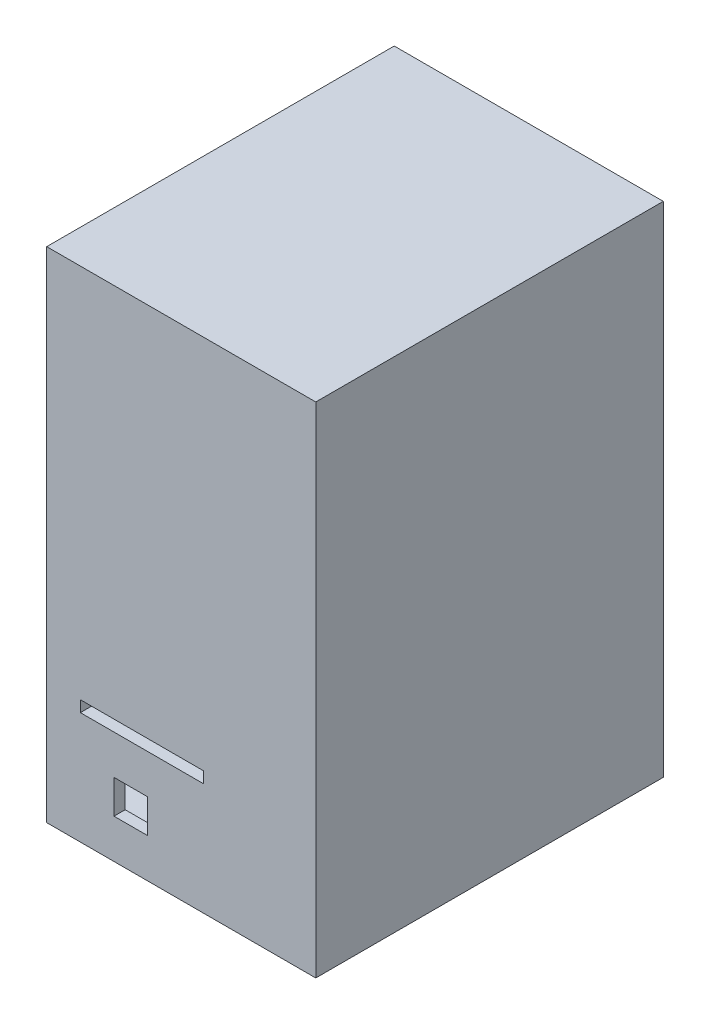
ISO-10303-21;
HEADER;
FILE_DESCRIPTION(('STEP AP214'),'2;1');
FILE_NAME('part.step','',(''),(''),'','','');
FILE_SCHEMA(('AUTOMOTIVE_DESIGN { 1 0 10303 214 1 1 1 1 }'));
ENDSEC;
DATA;
#1=APPLICATION_CONTEXT('core data for automotive mechanical design processes');
#2=APPLICATION_PROTOCOL_DEFINITION('international standard','automotive_design',2000,#1);
#3=PRODUCT_CONTEXT('',#1,'mechanical');
#4=PRODUCT('Part','Part','',(#3));
#5=PRODUCT_RELATED_PRODUCT_CATEGORY('part','',(#4));
#6=PRODUCT_DEFINITION_FORMATION('','',#4);
#7=PRODUCT_DEFINITION_CONTEXT('part definition',#1,'design');
#8=PRODUCT_DEFINITION('design','',#6,#7);
#9=PRODUCT_DEFINITION_SHAPE('','',#8);
#10=(LENGTH_UNIT() NAMED_UNIT(*) SI_UNIT(.MILLI.,.METRE.));
#11=(NAMED_UNIT(*) PLANE_ANGLE_UNIT() SI_UNIT($,.RADIAN.));
#12=(NAMED_UNIT(*) SI_UNIT($,.STERADIAN.) SOLID_ANGLE_UNIT());
#13=UNCERTAINTY_MEASURE_WITH_UNIT(LENGTH_MEASURE(1.E-05),#10,'distance_accuracy_value','');
#14=(GEOMETRIC_REPRESENTATION_CONTEXT(3) GLOBAL_UNCERTAINTY_ASSIGNED_CONTEXT((#13)) GLOBAL_UNIT_ASSIGNED_CONTEXT((#10,
#11,#12)) REPRESENTATION_CONTEXT('',''));
#15=CARTESIAN_POINT('',(0.,0.,0.));
#16=DIRECTION('',(0.,0.,1.));
#17=DIRECTION('',(1.,0.,0.));
#18=AXIS2_PLACEMENT_3D('',#15,#16,#17);
#19=CARTESIAN_POINT('',(-11.076923076923,-201.769230769231,-135.));
#20=DIRECTION('',(1.,0.,0.));
#21=DIRECTION('',(0.,1.,0.));
#22=AXIS2_PLACEMENT_3D('',#19,#20,#21);
#23=CYLINDRICAL_SURFACE('',#22,35.);
#24=CARTESIAN_POINT('',(-11.076923076923,-201.769230769231,-135.));
#25=DIRECTION('',(-1.,0.,0.));
#26=DIRECTION('',(0.,-1.,0.));
#27=AXIS2_PLACEMENT_3D('',#24,#25,#26);
#28=CIRCLE('',#27,35.);
#29=CARTESIAN_POINT('',(-11.076923076923,-236.769230769231,-135.));
#30=VERTEX_POINT('',#29);
#31=EDGE_CURVE('E11',#30,#30,#28,.T.);
#32=ORIENTED_EDGE('',*,*,#31,.F.);
#33=EDGE_LOOP('',(#32));
#34=FACE_BOUND('',#33,.T.);
#35=CARTESIAN_POINT('',(18.923076923077,-201.769230769231,-135.));
#36=DIRECTION('',(-1.,0.,0.));
#37=DIRECTION('',(0.,-1.,0.));
#38=AXIS2_PLACEMENT_3D('',#35,#36,#37);
#39=CIRCLE('',#38,35.);
#40=CARTESIAN_POINT('',(18.923076923077,-236.769230769231,-135.));
#41=VERTEX_POINT('',#40);
#42=EDGE_CURVE('E44',#41,#41,#39,.T.);
#43=ORIENTED_EDGE('',*,*,#42,.T.);
#44=EDGE_LOOP('',(#43));
#45=FACE_BOUND('',#44,.T.);
#46=ADVANCED_FACE('F41',(#34,#45),#23,.T.);
#47=CARTESIAN_POINT('',(-11.076923076923,-201.769230769231,-135.));
#48=DIRECTION('',(-1.,0.,0.));
#49=DIRECTION('',(0.,-1.,0.));
#50=AXIS2_PLACEMENT_3D('',#47,#48,#49);
#51=PLANE('',#50);
#52=ORIENTED_EDGE('',*,*,#31,.T.);
#53=EDGE_LOOP('',(#52));
#54=FACE_BOUND('',#53,.T.);
#55=ADVANCED_FACE('F56',(#54),#51,.T.);
#56=CARTESIAN_POINT('',(18.923076923077,-201.769230769231,-135.));
#57=DIRECTION('',(-1.,0.,0.));
#58=DIRECTION('',(0.,-1.,0.));
#59=AXIS2_PLACEMENT_3D('',#56,#57,#58);
#60=PLANE('',#59);
#61=ORIENTED_EDGE('',*,*,#42,.F.);
#62=EDGE_LOOP('',(#61));
#63=FACE_BOUND('',#62,.T.);
#64=ADVANCED_FACE('F54',(#63),#60,.F.);
#65=CLOSED_SHELL('',(#46,#55,#64));
#66=MANIFOLD_SOLID_BREP('B2',#65);
#67=CARTESIAN_POINT('',(0.,0.,-330.));
#68=DIRECTION('',(0.,0.,1.));
#69=DIRECTION('',(1.,0.,0.));
#70=AXIS2_PLACEMENT_3D('',#67,#68,#69);
#71=PLANE('',#70);
#72=DIRECTION('',(0.,-1.,0.));
#73=VECTOR('',#72,1.);
#74=CARTESIAN_POINT('',(68.923076923077,143.230769230769,-330.));
#75=LINE('',#74,#73);
#76=CARTESIAN_POINT('',(68.923076923077,143.230769230769,-330.));
#77=VERTEX_POINT('',#76);
#78=CARTESIAN_POINT('',(68.923076923077,-191.769230769231,-330.));
#79=VERTEX_POINT('',#78);
#80=EDGE_CURVE('E454',#77,#79,#75,.T.);
#81=ORIENTED_EDGE('',*,*,#80,.F.);
#82=DIRECTION('',(-1.,0.,0.));
#83=VECTOR('',#82,1.);
#84=CARTESIAN_POINT('',(0.,143.230769230769,-330.));
#85=LINE('',#84,#83);
#86=CARTESIAN_POINT('',(-61.076923076923,143.230769230769,-330.));
#87=VERTEX_POINT('',#86);
#88=EDGE_CURVE('E420',#77,#87,#85,.T.);
#89=ORIENTED_EDGE('',*,*,#88,.T.);
#90=DIRECTION('',(0.,-1.,0.));
#91=VECTOR('',#90,1.);
#92=CARTESIAN_POINT('',(-61.076923076923,0.,-330.));
#93=LINE('',#92,#91);
#94=CARTESIAN_POINT('',(-61.076923076923,-191.769230769231,-330.));
#95=VERTEX_POINT('',#94);
#96=EDGE_CURVE('E424',#87,#95,#93,.T.);
#97=ORIENTED_EDGE('',*,*,#96,.T.);
#98=DIRECTION('',(1.,0.,0.));
#99=VECTOR('',#98,1.);
#100=CARTESIAN_POINT('',(-61.076923076923,-191.769230769231,-330.));
#101=LINE('',#100,#99);
#102=EDGE_CURVE('E361',#95,#79,#101,.T.);
#103=ORIENTED_EDGE('',*,*,#102,.T.);
#104=EDGE_LOOP('',(#81,#89,#97,#103));
#105=FACE_BOUND('',#104,.T.);
#106=ADVANCED_FACE('F83',(#105),#71,.T.);
#107=CARTESIAN_POINT('',(-71.076923076923,143.230769230769,-340.));
#108=DIRECTION('',(0.,1.,0.));
#109=DIRECTION('',(0.,0.,1.));
#110=AXIS2_PLACEMENT_3D('',#107,#108,#109);
#111=PLANE('',#110);
#112=ORIENTED_EDGE('',*,*,#88,.F.);
#113=DIRECTION('',(0.,0.,-1.));
#114=VECTOR('',#113,1.);
#115=CARTESIAN_POINT('',(68.923076923077,143.230769230769,-30.));
#116=LINE('',#115,#114);
#117=CARTESIAN_POINT('',(68.923076923077,143.230769230769,-40.));
#118=VERTEX_POINT('',#117);
#119=EDGE_CURVE('E459',#118,#77,#116,.T.);
#120=ORIENTED_EDGE('',*,*,#119,.F.);
#121=DIRECTION('',(-1.,0.,0.));
#122=VECTOR('',#121,1.);
#123=CARTESIAN_POINT('',(-71.076923076923,143.230769230769,-40.));
#124=LINE('',#123,#122);
#125=CARTESIAN_POINT('',(-61.076923076923,143.230769230769,-40.));
#126=VERTEX_POINT('',#125);
#127=EDGE_CURVE('E380',#118,#126,#124,.T.);
#128=ORIENTED_EDGE('',*,*,#127,.T.);
#129=DIRECTION('',(0.,0.,1.));
#130=VECTOR('',#129,1.);
#131=CARTESIAN_POINT('',(-61.076923076923,143.230769230769,-340.));
#132=LINE('',#131,#130);
#133=EDGE_CURVE('E414',#87,#126,#132,.T.);
#134=ORIENTED_EDGE('',*,*,#133,.F.);
#135=EDGE_LOOP('',(#112,#120,#128,#134));
#136=FACE_BOUND('',#135,.T.);
#137=ADVANCED_FACE('F494',(#136),#111,.F.);
#138=CARTESIAN_POINT('',(-61.076923076923,-191.769230769231,-30.));
#139=DIRECTION('',(0.,1.,0.));
#140=DIRECTION('',(-1.,0.,0.));
#141=AXIS2_PLACEMENT_3D('',#138,#139,#140);
#142=PLANE('',#141);
#143=DIRECTION('',(0.,0.,1.));
#144=VECTOR('',#143,1.);
#145=CARTESIAN_POINT('',(-13.076923076923,-191.769230769231,-160.));
#146=LINE('',#145,#144);
#147=CARTESIAN_POINT('',(-13.076923076923,-191.769230769231,-160.));
#148=VERTEX_POINT('',#147);
#149=CARTESIAN_POINT('',(-13.076923076923,-191.769230769231,-85.));
#150=VERTEX_POINT('',#149);
#151=EDGE_CURVE('E325',#148,#150,#146,.T.);
#152=ORIENTED_EDGE('',*,*,#151,.F.);
#153=DIRECTION('',(-1.,0.,0.));
#154=VECTOR('',#153,1.);
#155=CARTESIAN_POINT('',(-13.076923076923,-191.769230769231,-160.));
#156=LINE('',#155,#154);
#157=CARTESIAN_POINT('',(20.923076923077,-191.769230769231,-160.));
#158=VERTEX_POINT('',#157);
#159=EDGE_CURVE('E333',#158,#148,#156,.T.);
#160=ORIENTED_EDGE('',*,*,#159,.F.);
#161=DIRECTION('',(0.,0.,-1.));
#162=VECTOR('',#161,1.);
#163=CARTESIAN_POINT('',(20.923076923077,-191.769230769231,-160.));
#164=LINE('',#163,#162);
#165=CARTESIAN_POINT('',(20.923076923077,-191.769230769231,-85.));
#166=VERTEX_POINT('',#165);
#167=EDGE_CURVE('E330',#166,#158,#164,.T.);
#168=ORIENTED_EDGE('',*,*,#167,.F.);
#169=DIRECTION('',(1.,0.,0.));
#170=VECTOR('',#169,1.);
#171=CARTESIAN_POINT('',(-13.076923076923,-191.769230769231,-85.));
#172=LINE('',#171,#170);
#173=EDGE_CURVE('E327',#150,#166,#172,.T.);
#174=ORIENTED_EDGE('',*,*,#173,.F.);
#175=EDGE_LOOP('',(#152,#160,#168,#174));
#176=FACE_BOUND('',#175,.T.);
#177=DIRECTION('',(0.,0.,-1.));
#178=VECTOR('',#177,1.);
#179=CARTESIAN_POINT('',(68.923076923077,-191.769230769231,-30.));
#180=LINE('',#179,#178);
#181=CARTESIAN_POINT('',(68.923076923077,-191.769230769231,-30.0000000000002));
#182=VERTEX_POINT('',#181);
#183=EDGE_CURVE('E39',#182,#79,#180,.T.);
#184=ORIENTED_EDGE('',*,*,#183,.T.);
#185=ORIENTED_EDGE('',*,*,#102,.F.);
#186=DIRECTION('',(0.,0.,-1.));
#187=VECTOR('',#186,1.);
#188=CARTESIAN_POINT('',(-61.076923076923,-191.769230769231,-30.));
#189=LINE('',#188,#187);
#190=CARTESIAN_POINT('',(-61.076923076923,-191.769230769231,-40.));
#191=VERTEX_POINT('',#190);
#192=EDGE_CURVE('E367',#191,#95,#189,.T.);
#193=ORIENTED_EDGE('',*,*,#192,.F.);
#194=DIRECTION('',(-1.,0.,0.));
#195=VECTOR('',#194,1.);
#196=CARTESIAN_POINT('',(-61.076923076923,-191.769230769231,-39.9999999999999));
#197=LINE('',#196,#195);
#198=CARTESIAN_POINT('',(-41.076923076923,-191.769230769231,-40.));
#199=VERTEX_POINT('',#198);
#200=EDGE_CURVE('E428',#199,#191,#197,.T.);
#201=ORIENTED_EDGE('',*,*,#200,.F.);
#202=DIRECTION('',(0.,0.,1.));
#203=VECTOR('',#202,1.);
#204=CARTESIAN_POINT('',(-41.076923076923,-191.769230769231,-40.));
#205=LINE('',#204,#203);
#206=CARTESIAN_POINT('',(-41.076923076923,-191.769230769231,-30.0000000000002));
#207=VERTEX_POINT('',#206);
#208=EDGE_CURVE('E306',#199,#207,#205,.T.);
#209=ORIENTED_EDGE('',*,*,#208,.T.);
#210=DIRECTION('',(1.,0.,0.));
#211=VECTOR('',#210,1.);
#212=CARTESIAN_POINT('',(-41.076923076923,-191.769230769231,-30.0000000000002));
#213=LINE('',#212,#211);
#214=EDGE_CURVE('E308',#207,#182,#213,.T.);
#215=ORIENTED_EDGE('',*,*,#214,.T.);
#216=EDGE_LOOP('',(#184,#185,#193,#201,#209,#215));
#217=FACE_BOUND('',#216,.T.);
#218=ADVANCED_FACE('F531',(#176,#217),#142,.T.);
#219=CARTESIAN_POINT('',(-61.076923076923,153.230769230769,-340.));
#220=DIRECTION('',(-1.,0.,0.));
#221=DIRECTION('',(0.,-1.,0.));
#222=AXIS2_PLACEMENT_3D('',#219,#220,#221);
#223=PLANE('',#222);
#224=DIRECTION('',(0.,0.,-1.));
#225=VECTOR('',#224,1.);
#226=CARTESIAN_POINT('',(-61.076923076923,-201.769230769231,-30.));
#227=LINE('',#226,#225);
#228=CARTESIAN_POINT('',(-61.076923076923,-201.769230769231,-39.9999999999999));
#229=VERTEX_POINT('',#228);
#230=CARTESIAN_POINT('',(-61.076923076923,-201.769230769231,-330.));
#231=VERTEX_POINT('',#230);
#232=EDGE_CURVE('E364',#229,#231,#227,.T.);
#233=ORIENTED_EDGE('',*,*,#232,.F.);
#234=DIRECTION('',(0.,-1.,0.));
#235=VECTOR('',#234,1.);
#236=CARTESIAN_POINT('',(-61.076923076923,153.230769230769,-40.));
#237=LINE('',#236,#235);
#238=CARTESIAN_POINT('',(-61.076923076923,-281.769230769231,-40.));
#239=VERTEX_POINT('',#238);
#240=EDGE_CURVE('E383',#229,#239,#237,.T.);
#241=ORIENTED_EDGE('',*,*,#240,.T.);
#242=DIRECTION('',(0.,0.,1.));
#243=VECTOR('',#242,1.);
#244=CARTESIAN_POINT('',(-61.076923076923,-281.769230769231,-340.));
#245=LINE('',#244,#243);
#246=CARTESIAN_POINT('',(-61.076923076923,-281.769230769231,-330.));
#247=VERTEX_POINT('',#246);
#248=EDGE_CURVE('E421',#247,#239,#245,.T.);
#249=ORIENTED_EDGE('',*,*,#248,.F.);
#250=EDGE_CURVE('E399',#231,#247,#93,.T.);
#251=ORIENTED_EDGE('',*,*,#250,.F.);
#252=EDGE_LOOP('',(#233,#241,#249,#251));
#253=FACE_BOUND('',#252,.T.);
#254=ADVANCED_FACE('F553',(#253),#223,.F.);
#255=CARTESIAN_POINT('',(158.923076923077,153.230769230769,-340.));
#256=DIRECTION('',(1.,0.,0.));
#257=DIRECTION('',(0.,1.,0.));
#258=AXIS2_PLACEMENT_3D('',#255,#256,#257);
#259=PLANE('',#258);
#260=DIRECTION('',(0.,0.,1.));
#261=VECTOR('',#260,1.);
#262=CARTESIAN_POINT('',(158.923076923077,-201.769230769231,-340.));
#263=LINE('',#262,#261);
#264=CARTESIAN_POINT('',(158.923076923077,-201.769230769231,-330.));
#265=VERTEX_POINT('',#264);
#266=CARTESIAN_POINT('',(158.923076923077,-201.769230769231,-40.));
#267=VERTEX_POINT('',#266);
#268=EDGE_CURVE('E373',#265,#267,#263,.T.);
#269=ORIENTED_EDGE('',*,*,#268,.F.);
#270=DIRECTION('',(0.,1.,0.));
#271=VECTOR('',#270,1.);
#272=CARTESIAN_POINT('',(158.923076923077,0.,-330.));
#273=LINE('',#272,#271);
#274=CARTESIAN_POINT('',(158.923076923077,-281.769230769231,-330.));
#275=VERTEX_POINT('',#274);
#276=EDGE_CURVE('E410',#275,#265,#273,.T.);
#277=ORIENTED_EDGE('',*,*,#276,.F.);
#278=DIRECTION('',(0.,0.,1.));
#279=VECTOR('',#278,1.);
#280=CARTESIAN_POINT('',(158.923076923077,-281.769230769231,-340.));
#281=LINE('',#280,#279);
#282=CARTESIAN_POINT('',(158.923076923077,-281.769230769231,-40.));
#283=VERTEX_POINT('',#282);
#284=EDGE_CURVE('E400',#275,#283,#281,.T.);
#285=ORIENTED_EDGE('',*,*,#284,.T.);
#286=DIRECTION('',(0.,1.,0.));
#287=VECTOR('',#286,1.);
#288=CARTESIAN_POINT('',(158.923076923077,153.230769230769,-40.));
#289=LINE('',#288,#287);
#290=EDGE_CURVE('E377',#283,#267,#289,.T.);
#291=ORIENTED_EDGE('',*,*,#290,.T.);
#292=EDGE_LOOP('',(#269,#277,#285,#291));
#293=FACE_BOUND('',#292,.T.);
#294=ADVANCED_FACE('F501',(#293),#259,.F.);
#295=ORIENTED_EDGE('',*,*,#276,.T.);
#296=DIRECTION('',(1.,0.,0.));
#297=VECTOR('',#296,1.);
#298=CARTESIAN_POINT('',(-61.076923076923,-201.769230769231,-330.));
#299=LINE('',#298,#297);
#300=EDGE_CURVE('E357',#231,#265,#299,.T.);
#301=ORIENTED_EDGE('',*,*,#300,.F.);
#302=ORIENTED_EDGE('',*,*,#250,.T.);
#303=DIRECTION('',(1.,0.,0.));
#304=VECTOR('',#303,1.);
#305=CARTESIAN_POINT('',(0.,-281.769230769231,-330.));
#306=LINE('',#305,#304);
#307=EDGE_CURVE('E404',#247,#275,#306,.T.);
#308=ORIENTED_EDGE('',*,*,#307,.T.);
#309=EDGE_LOOP('',(#295,#301,#302,#308));
#310=FACE_BOUND('',#309,.T.);
#311=ADVANCED_FACE('F488',(#310),#71,.T.);
#312=EDGE_CURVE('E384',#126,#191,#237,.T.);
#313=ORIENTED_EDGE('',*,*,#312,.T.);
#314=ORIENTED_EDGE('',*,*,#192,.T.);
#315=ORIENTED_EDGE('',*,*,#96,.F.);
#316=ORIENTED_EDGE('',*,*,#133,.T.);
#317=EDGE_LOOP('',(#313,#314,#315,#316));
#318=FACE_BOUND('',#317,.T.);
#319=ADVANCED_FACE('F500',(#318),#223,.F.);
#320=CARTESIAN_POINT('',(-71.076923076923,-281.769230769231,-340.));
#321=DIRECTION('',(0.,-1.,0.));
#322=DIRECTION('',(0.,0.,-1.));
#323=AXIS2_PLACEMENT_3D('',#320,#321,#322);
#324=PLANE('',#323);
#325=ORIENTED_EDGE('',*,*,#248,.T.);
#326=DIRECTION('',(1.,0.,0.));
#327=VECTOR('',#326,1.);
#328=CARTESIAN_POINT('',(-71.076923076923,-281.769230769231,-39.9999999999999));
#329=LINE('',#328,#327);
#330=EDGE_CURVE('E403',#239,#283,#329,.T.);
#331=ORIENTED_EDGE('',*,*,#330,.T.);
#332=ORIENTED_EDGE('',*,*,#284,.F.);
#333=ORIENTED_EDGE('',*,*,#307,.F.);
#334=EDGE_LOOP('',(#325,#331,#332,#333));
#335=FACE_BOUND('',#334,.T.);
#336=ADVANCED_FACE('F551',(#335),#324,.F.);
#337=CARTESIAN_POINT('',(-61.076923076923,-201.769230769231,-30.));
#338=DIRECTION('',(0.,1.,0.));
#339=DIRECTION('',(-1.,0.,0.));
#340=AXIS2_PLACEMENT_3D('',#337,#338,#339);
#341=PLANE('',#340);
#342=DIRECTION('',(-1.,0.,0.));
#343=VECTOR('',#342,1.);
#344=CARTESIAN_POINT('',(-61.076923076923,-201.769230769231,-160.));
#345=LINE('',#344,#343);
#346=CARTESIAN_POINT('',(20.923076923077,-201.769230769231,-160.));
#347=VERTEX_POINT('',#346);
#348=CARTESIAN_POINT('',(-13.076923076923,-201.769230769231,-160.));
#349=VERTEX_POINT('',#348);
#350=EDGE_CURVE('E351',#347,#349,#345,.T.);
#351=ORIENTED_EDGE('',*,*,#350,.T.);
#352=DIRECTION('',(0.,0.,1.));
#353=VECTOR('',#352,1.);
#354=CARTESIAN_POINT('',(-13.076923076923,-201.769230769231,-30.));
#355=LINE('',#354,#353);
#356=CARTESIAN_POINT('',(-13.076923076923,-201.769230769231,-85.));
#357=VERTEX_POINT('',#356);
#358=EDGE_CURVE('E354',#349,#357,#355,.T.);
#359=ORIENTED_EDGE('',*,*,#358,.T.);
#360=DIRECTION('',(1.,0.,0.));
#361=VECTOR('',#360,1.);
#362=CARTESIAN_POINT('',(-61.076923076923,-201.769230769231,-85.));
#363=LINE('',#362,#361);
#364=CARTESIAN_POINT('',(20.9230769230771,-201.769230769231,-85.));
#365=VERTEX_POINT('',#364);
#366=EDGE_CURVE('E339',#357,#365,#363,.T.);
#367=ORIENTED_EDGE('',*,*,#366,.T.);
#368=DIRECTION('',(0.,0.,-1.));
#369=VECTOR('',#368,1.);
#370=CARTESIAN_POINT('',(20.9230769230771,-201.769230769231,-30.));
#371=LINE('',#370,#369);
#372=EDGE_CURVE('E348',#365,#347,#371,.T.);
#373=ORIENTED_EDGE('',*,*,#372,.T.);
#374=EDGE_LOOP('',(#351,#359,#367,#373));
#375=FACE_BOUND('',#374,.T.);
#376=ORIENTED_EDGE('',*,*,#268,.T.);
#377=DIRECTION('',(-1.,0.,0.));
#378=VECTOR('',#377,1.);
#379=CARTESIAN_POINT('',(428.923076923077,-201.769230769231,-39.9999999999999));
#380=LINE('',#379,#378);
#381=EDGE_CURVE('E318',#267,#229,#380,.T.);
#382=ORIENTED_EDGE('',*,*,#381,.T.);
#383=ORIENTED_EDGE('',*,*,#232,.T.);
#384=ORIENTED_EDGE('',*,*,#300,.T.);
#385=EDGE_LOOP('',(#376,#382,#383,#384));
#386=FACE_BOUND('',#385,.T.);
#387=ADVANCED_FACE('F557',(#375,#386),#341,.F.);
#388=CARTESIAN_POINT('',(-13.076923076923,-218.76923076923,-160.));
#389=DIRECTION('',(-1.,0.,0.));
#390=DIRECTION('',(0.,-1.,0.));
#391=AXIS2_PLACEMENT_3D('',#388,#389,#390);
#392=PLANE('',#391);
#393=DIRECTION('',(0.,1.,0.));
#394=VECTOR('',#393,1.);
#395=CARTESIAN_POINT('',(-13.076923076923,-218.76923076923,-160.));
#396=LINE('',#395,#394);
#397=EDGE_CURVE('E337',#349,#148,#396,.T.);
#398=ORIENTED_EDGE('',*,*,#397,.T.);
#399=ORIENTED_EDGE('',*,*,#151,.T.);
#400=DIRECTION('',(0.,1.,0.));
#401=VECTOR('',#400,1.);
#402=CARTESIAN_POINT('',(-13.076923076923,-218.76923076923,-85.));
#403=LINE('',#402,#401);
#404=EDGE_CURVE('E336',#357,#150,#403,.T.);
#405=ORIENTED_EDGE('',*,*,#404,.F.);
#406=ORIENTED_EDGE('',*,*,#358,.F.);
#407=EDGE_LOOP('',(#398,#399,#405,#406));
#408=FACE_BOUND('',#407,.T.);
#409=ADVANCED_FACE('F578',(#408),#392,.F.);
#410=CARTESIAN_POINT('',(-13.076923076923,-218.76923076923,-160.));
#411=DIRECTION('',(0.,0.,-1.));
#412=DIRECTION('',(-1.,0.,0.));
#413=AXIS2_PLACEMENT_3D('',#410,#411,#412);
#414=PLANE('',#413);
#415=DIRECTION('',(0.,1.,0.));
#416=VECTOR('',#415,1.);
#417=CARTESIAN_POINT('',(20.923076923077,-218.76923076923,-160.));
#418=LINE('',#417,#416);
#419=EDGE_CURVE('E340',#347,#158,#418,.T.);
#420=ORIENTED_EDGE('',*,*,#419,.T.);
#421=ORIENTED_EDGE('',*,*,#159,.T.);
#422=ORIENTED_EDGE('',*,*,#397,.F.);
#423=ORIENTED_EDGE('',*,*,#350,.F.);
#424=EDGE_LOOP('',(#420,#421,#422,#423));
#425=FACE_BOUND('',#424,.T.);
#426=ADVANCED_FACE('F584',(#425),#414,.F.);
#427=CARTESIAN_POINT('',(20.923076923077,-218.76923076923,-160.));
#428=DIRECTION('',(1.,0.,0.));
#429=DIRECTION('',(0.,0.,-1.));
#430=AXIS2_PLACEMENT_3D('',#427,#428,#429);
#431=PLANE('',#430);
#432=DIRECTION('',(0.,1.,0.));
#433=VECTOR('',#432,1.);
#434=CARTESIAN_POINT('',(20.923076923077,-218.76923076923,-85.));
#435=LINE('',#434,#433);
#436=EDGE_CURVE('E342',#365,#166,#435,.T.);
#437=ORIENTED_EDGE('',*,*,#436,.T.);
#438=ORIENTED_EDGE('',*,*,#167,.T.);
#439=ORIENTED_EDGE('',*,*,#419,.F.);
#440=ORIENTED_EDGE('',*,*,#372,.F.);
#441=EDGE_LOOP('',(#437,#438,#439,#440));
#442=FACE_BOUND('',#441,.T.);
#443=ADVANCED_FACE('F678',(#442),#431,.F.);
#444=CARTESIAN_POINT('',(-13.076923076923,-218.76923076923,-85.));
#445=DIRECTION('',(0.,0.,1.));
#446=DIRECTION('',(1.,0.,0.));
#447=AXIS2_PLACEMENT_3D('',#444,#445,#446);
#448=PLANE('',#447);
#449=ORIENTED_EDGE('',*,*,#404,.T.);
#450=ORIENTED_EDGE('',*,*,#173,.T.);
#451=ORIENTED_EDGE('',*,*,#436,.F.);
#452=ORIENTED_EDGE('',*,*,#366,.F.);
#453=EDGE_LOOP('',(#449,#450,#451,#452));
#454=FACE_BOUND('',#453,.T.);
#455=ADVANCED_FACE('F512',(#454),#448,.F.);
#456=CARTESIAN_POINT('',(0.,0.,-40.));
#457=DIRECTION('',(0.,0.,1.));
#458=DIRECTION('',(1.,0.,0.));
#459=AXIS2_PLACEMENT_3D('',#456,#457,#458);
#460=PLANE('',#459);
#461=DIRECTION('',(-1.,0.,0.));
#462=VECTOR('',#461,1.);
#463=CARTESIAN_POINT('',(-41.076923076923,-181.769230769231,-40.));
#464=LINE('',#463,#462);
#465=CARTESIAN_POINT('',(68.923076923077,-181.769230769231,-40.));
#466=VERTEX_POINT('',#465);
#467=CARTESIAN_POINT('',(-41.076923076923,-181.769230769231,-40.));
#468=VERTEX_POINT('',#467);
#469=EDGE_CURVE('E302',#466,#468,#464,.T.);
#470=ORIENTED_EDGE('',*,*,#469,.T.);
#471=DIRECTION('',(0.,-1.,0.));
#472=VECTOR('',#471,1.);
#473=CARTESIAN_POINT('',(-41.076923076923,-181.769230769231,-40.));
#474=LINE('',#473,#472);
#475=EDGE_CURVE('E299',#468,#199,#474,.T.);
#476=ORIENTED_EDGE('',*,*,#475,.T.);
#477=ORIENTED_EDGE('',*,*,#200,.T.);
#478=ORIENTED_EDGE('',*,*,#312,.F.);
#479=ORIENTED_EDGE('',*,*,#127,.F.);
#480=DIRECTION('',(0.,1.,0.));
#481=VECTOR('',#480,1.);
#482=CARTESIAN_POINT('',(68.923076923077,143.230769230769,-39.9999999999999));
#483=LINE('',#482,#481);
#484=EDGE_CURVE('E452',#466,#118,#483,.T.);
#485=ORIENTED_EDGE('',*,*,#484,.F.);
#486=EDGE_LOOP('',(#470,#476,#477,#478,#479,#485));
#487=FACE_BOUND('',#486,.T.);
#488=ADVANCED_FACE('F505',(#487),#460,.F.);
#489=CARTESIAN_POINT('',(68.923076923077,143.230769230769,-30.));
#490=DIRECTION('',(1.,0.,0.));
#491=DIRECTION('',(0.,1.,0.));
#492=AXIS2_PLACEMENT_3D('',#489,#490,#491);
#493=PLANE('',#492);
#494=ORIENTED_EDGE('',*,*,#183,.F.);
#495=DIRECTION('',(0.,1.,0.));
#496=VECTOR('',#495,1.);
#497=CARTESIAN_POINT('',(68.923076923077,-181.769230769231,-30.0000000000002));
#498=LINE('',#497,#496);
#499=CARTESIAN_POINT('',(68.923076923077,-181.769230769231,-30.0000000000002));
#500=VERTEX_POINT('',#499);
#501=EDGE_CURVE('E311',#182,#500,#498,.T.);
#502=ORIENTED_EDGE('',*,*,#501,.T.);
#503=DIRECTION('',(0.,0.,1.));
#504=VECTOR('',#503,1.);
#505=CARTESIAN_POINT('',(68.923076923077,-181.769230769231,-40.));
#506=LINE('',#505,#504);
#507=EDGE_CURVE('E319',#466,#500,#506,.T.);
#508=ORIENTED_EDGE('',*,*,#507,.F.);
#509=ORIENTED_EDGE('',*,*,#484,.T.);
#510=ORIENTED_EDGE('',*,*,#119,.T.);
#511=ORIENTED_EDGE('',*,*,#80,.T.);
#512=EDGE_LOOP('',(#494,#502,#508,#509,#510,#511));
#513=FACE_BOUND('',#512,.T.);
#514=ADVANCED_FACE('F85',(#513),#493,.F.);
#515=DIRECTION('',(-1.,0.,0.));
#516=VECTOR('',#515,1.);
#517=CARTESIAN_POINT('',(-11.076923076923,-226.769230769231,-40.));
#518=LINE('',#517,#516);
#519=CARTESIAN_POINT('',(18.923076923077,-226.769230769231,-40.));
#520=VERTEX_POINT('',#519);
#521=CARTESIAN_POINT('',(-11.076923076923,-226.769230769231,-40.));
#522=VERTEX_POINT('',#521);
#523=EDGE_CURVE('E270',#520,#522,#518,.T.);
#524=ORIENTED_EDGE('',*,*,#523,.T.);
#525=DIRECTION('',(0.,-1.,0.));
#526=VECTOR('',#525,1.);
#527=CARTESIAN_POINT('',(-11.076923076923,-226.769230769231,-40.));
#528=LINE('',#527,#526);
#529=CARTESIAN_POINT('',(-11.076923076923,-256.769230769231,-40.));
#530=VERTEX_POINT('',#529);
#531=EDGE_CURVE('E264',#522,#530,#528,.T.);
#532=ORIENTED_EDGE('',*,*,#531,.T.);
#533=DIRECTION('',(1.,0.,0.));
#534=VECTOR('',#533,1.);
#535=CARTESIAN_POINT('',(-11.076923076923,-256.769230769231,-40.));
#536=LINE('',#535,#534);
#537=CARTESIAN_POINT('',(18.923076923077,-256.769230769231,-40.));
#538=VERTEX_POINT('',#537);
#539=EDGE_CURVE('E273',#530,#538,#536,.T.);
#540=ORIENTED_EDGE('',*,*,#539,.T.);
#541=DIRECTION('',(0.,1.,0.));
#542=VECTOR('',#541,1.);
#543=CARTESIAN_POINT('',(18.923076923077,-226.769230769231,-40.));
#544=LINE('',#543,#542);
#545=EDGE_CURVE('E99',#538,#520,#544,.T.);
#546=ORIENTED_EDGE('',*,*,#545,.T.);
#547=EDGE_LOOP('',(#524,#532,#540,#546));
#548=FACE_BOUND('',#547,.T.);
#549=ORIENTED_EDGE('',*,*,#330,.F.);
#550=ORIENTED_EDGE('',*,*,#240,.F.);
#551=ORIENTED_EDGE('',*,*,#381,.F.);
#552=ORIENTED_EDGE('',*,*,#290,.F.);
#553=EDGE_LOOP('',(#549,#550,#551,#552));
#554=FACE_BOUND('',#553,.T.);
#555=ADVANCED_FACE('F277',(#548,#554),#460,.F.);
#556=CARTESIAN_POINT('',(-41.076923076923,-181.769230769231,-40.));
#557=DIRECTION('',(-1.,0.,0.));
#558=DIRECTION('',(0.,0.,1.));
#559=AXIS2_PLACEMENT_3D('',#556,#557,#558);
#560=PLANE('',#559);
#561=DIRECTION('',(0.,-1.,0.));
#562=VECTOR('',#561,1.);
#563=CARTESIAN_POINT('',(-41.076923076923,-181.769230769231,-30.0000000000002));
#564=LINE('',#563,#562);
#565=CARTESIAN_POINT('',(-41.076923076923,-181.769230769231,-30.0000000000002));
#566=VERTEX_POINT('',#565);
#567=EDGE_CURVE('E295',#566,#207,#564,.T.);
#568=ORIENTED_EDGE('',*,*,#567,.T.);
#569=ORIENTED_EDGE('',*,*,#208,.F.);
#570=ORIENTED_EDGE('',*,*,#475,.F.);
#571=DIRECTION('',(0.,0.,1.));
#572=VECTOR('',#571,1.);
#573=CARTESIAN_POINT('',(-41.076923076923,-181.769230769231,-40.));
#574=LINE('',#573,#572);
#575=EDGE_CURVE('E316',#468,#566,#574,.T.);
#576=ORIENTED_EDGE('',*,*,#575,.T.);
#577=EDGE_LOOP('',(#568,#569,#570,#576));
#578=FACE_BOUND('',#577,.T.);
#579=ADVANCED_FACE('F515',(#578),#560,.F.);
#580=CARTESIAN_POINT('',(-41.076923076923,-181.769230769231,-40.));
#581=DIRECTION('',(0.,1.,0.));
#582=DIRECTION('',(0.,0.,1.));
#583=AXIS2_PLACEMENT_3D('',#580,#581,#582);
#584=PLANE('',#583);
#585=DIRECTION('',(-1.,0.,0.));
#586=VECTOR('',#585,1.);
#587=CARTESIAN_POINT('',(-41.076923076923,-181.769230769231,-30.0000000000002));
#588=LINE('',#587,#586);
#589=EDGE_CURVE('E303',#500,#566,#588,.T.);
#590=ORIENTED_EDGE('',*,*,#589,.T.);
#591=ORIENTED_EDGE('',*,*,#575,.F.);
#592=ORIENTED_EDGE('',*,*,#469,.F.);
#593=ORIENTED_EDGE('',*,*,#507,.T.);
#594=EDGE_LOOP('',(#590,#591,#592,#593));
#595=FACE_BOUND('',#594,.T.);
#596=ADVANCED_FACE('F520',(#595),#584,.F.);
#597=CARTESIAN_POINT('',(-71.076923076923,153.230769230769,-30.0000000000002));
#598=DIRECTION('',(1.,0.,0.));
#599=DIRECTION('',(0.,0.,-1.));
#600=AXIS2_PLACEMENT_3D('',#597,#598,#599);
#601=PLANE('',#600);
#602=DIRECTION('',(0.,0.,-1.));
#603=VECTOR('',#602,1.);
#604=CARTESIAN_POINT('',(-71.076923076923,153.230769230769,-30.0000000000002));
#605=LINE('',#604,#603);
#606=CARTESIAN_POINT('',(-71.076923076923,153.230769230769,-30.0000000000002));
#607=VERTEX_POINT('',#606);
#608=CARTESIAN_POINT('',(-71.076923076923,153.230769230769,-340.));
#609=VERTEX_POINT('',#608);
#610=EDGE_CURVE('E441',#607,#609,#605,.T.);
#611=ORIENTED_EDGE('',*,*,#610,.T.);
#612=DIRECTION('',(0.,-1.,0.));
#613=VECTOR('',#612,1.);
#614=CARTESIAN_POINT('',(-71.076923076923,153.230769230769,-340.));
#615=LINE('',#614,#613);
#616=CARTESIAN_POINT('',(-71.076923076923,-291.769230769231,-340.));
#617=VERTEX_POINT('',#616);
#618=EDGE_CURVE('E387',#609,#617,#615,.T.);
#619=ORIENTED_EDGE('',*,*,#618,.T.);
#620=DIRECTION('',(0.,0.,-1.));
#621=VECTOR('',#620,1.);
#622=CARTESIAN_POINT('',(-71.076923076923,-291.769230769231,-30.0000000000002));
#623=LINE('',#622,#621);
#624=CARTESIAN_POINT('',(-71.076923076923,-291.769230769231,-30.0000000000002));
#625=VERTEX_POINT('',#624);
#626=EDGE_CURVE('E447',#625,#617,#623,.T.);
#627=ORIENTED_EDGE('',*,*,#626,.F.);
#628=DIRECTION('',(0.,-1.,0.));
#629=VECTOR('',#628,1.);
#630=CARTESIAN_POINT('',(-71.076923076923,153.230769230769,-30.0000000000002));
#631=LINE('',#630,#629);
#632=EDGE_CURVE('E432',#607,#625,#631,.T.);
#633=ORIENTED_EDGE('',*,*,#632,.F.);
#634=EDGE_LOOP('',(#611,#619,#627,#633));
#635=FACE_BOUND('',#634,.T.);
#636=ADVANCED_FACE('F615',(#635),#601,.F.);
#637=CARTESIAN_POINT('',(-71.076923076923,-291.769230769231,-30.0000000000002));
#638=DIRECTION('',(0.,1.,0.));
#639=DIRECTION('',(0.,0.,1.));
#640=AXIS2_PLACEMENT_3D('',#637,#638,#639);
#641=PLANE('',#640);
#642=ORIENTED_EDGE('',*,*,#626,.T.);
#643=DIRECTION('',(1.,0.,0.));
#644=VECTOR('',#643,1.);
#645=CARTESIAN_POINT('',(-71.076923076923,-291.769230769231,-340.));
#646=LINE('',#645,#644);
#647=CARTESIAN_POINT('',(168.923076923077,-291.769230769231,-340.));
#648=VERTEX_POINT('',#647);
#649=EDGE_CURVE('E390',#617,#648,#646,.T.);
#650=ORIENTED_EDGE('',*,*,#649,.T.);
#651=DIRECTION('',(0.,0.,-1.));
#652=VECTOR('',#651,1.);
#653=CARTESIAN_POINT('',(168.923076923077,-291.769230769231,-30.0000000000002));
#654=LINE('',#653,#652);
#655=CARTESIAN_POINT('',(168.923076923077,-291.769230769231,-30.0000000000002));
#656=VERTEX_POINT('',#655);
#657=EDGE_CURVE('E445',#656,#648,#654,.T.);
#658=ORIENTED_EDGE('',*,*,#657,.F.);
#659=DIRECTION('',(1.,0.,0.));
#660=VECTOR('',#659,1.);
#661=CARTESIAN_POINT('',(-71.076923076923,-291.769230769231,-30.0000000000002));
#662=LINE('',#661,#660);
#663=EDGE_CURVE('E435',#625,#656,#662,.T.);
#664=ORIENTED_EDGE('',*,*,#663,.F.);
#665=EDGE_LOOP('',(#642,#650,#658,#664));
#666=FACE_BOUND('',#665,.T.);
#667=ADVANCED_FACE('F614',(#666),#641,.F.);
#668=CARTESIAN_POINT('',(168.923076923077,153.230769230769,-30.0000000000002));
#669=DIRECTION('',(-1.,0.,0.));
#670=DIRECTION('',(0.,0.,1.));
#671=AXIS2_PLACEMENT_3D('',#668,#669,#670);
#672=PLANE('',#671);
#673=ORIENTED_EDGE('',*,*,#657,.T.);
#674=DIRECTION('',(0.,1.,0.));
#675=VECTOR('',#674,1.);
#676=CARTESIAN_POINT('',(168.923076923077,153.230769230769,-340.));
#677=LINE('',#676,#675);
#678=CARTESIAN_POINT('',(168.923076923077,153.230769230769,-340.));
#679=VERTEX_POINT('',#678);
#680=EDGE_CURVE('E393',#648,#679,#677,.T.);
#681=ORIENTED_EDGE('',*,*,#680,.T.);
#682=DIRECTION('',(0.,0.,-1.));
#683=VECTOR('',#682,1.);
#684=CARTESIAN_POINT('',(168.923076923077,153.230769230769,-30.0000000000002));
#685=LINE('',#684,#683);
#686=CARTESIAN_POINT('',(168.923076923077,153.230769230769,-30.0000000000002));
#687=VERTEX_POINT('',#686);
#688=EDGE_CURVE('E443',#687,#679,#685,.T.);
#689=ORIENTED_EDGE('',*,*,#688,.F.);
#690=DIRECTION('',(0.,1.,0.));
#691=VECTOR('',#690,1.);
#692=CARTESIAN_POINT('',(168.923076923077,153.230769230769,-30.0000000000002));
#693=LINE('',#692,#691);
#694=EDGE_CURVE('E437',#656,#687,#693,.T.);
#695=ORIENTED_EDGE('',*,*,#694,.F.);
#696=EDGE_LOOP('',(#673,#681,#689,#695));
#697=FACE_BOUND('',#696,.T.);
#698=ADVANCED_FACE('F611',(#697),#672,.F.);
#699=CARTESIAN_POINT('',(-71.076923076923,153.230769230769,-30.0000000000002));
#700=DIRECTION('',(0.,-1.,0.));
#701=DIRECTION('',(0.,0.,-1.));
#702=AXIS2_PLACEMENT_3D('',#699,#700,#701);
#703=PLANE('',#702);
#704=ORIENTED_EDGE('',*,*,#688,.T.);
#705=DIRECTION('',(-1.,0.,0.));
#706=VECTOR('',#705,1.);
#707=CARTESIAN_POINT('',(-71.076923076923,153.230769230769,-340.));
#708=LINE('',#707,#706);
#709=EDGE_CURVE('E396',#679,#609,#708,.T.);
#710=ORIENTED_EDGE('',*,*,#709,.T.);
#711=ORIENTED_EDGE('',*,*,#610,.F.);
#712=DIRECTION('',(-1.,0.,0.));
#713=VECTOR('',#712,1.);
#714=CARTESIAN_POINT('',(-71.076923076923,153.230769230769,-30.0000000000002));
#715=LINE('',#714,#713);
#716=EDGE_CURVE('E439',#687,#607,#715,.T.);
#717=ORIENTED_EDGE('',*,*,#716,.F.);
#718=EDGE_LOOP('',(#704,#710,#711,#717));
#719=FACE_BOUND('',#718,.T.);
#720=ADVANCED_FACE('F596',(#719),#703,.F.);
#721=CARTESIAN_POINT('',(0.,0.,-30.0000000000002));
#722=DIRECTION('',(0.,0.,1.));
#723=DIRECTION('',(1.,0.,0.));
#724=AXIS2_PLACEMENT_3D('',#721,#722,#723);
#725=PLANE('',#724);
#726=DIRECTION('',(0.,-1.,0.));
#727=VECTOR('',#726,1.);
#728=CARTESIAN_POINT('',(-11.076923076923,-226.769230769231,-30.0000000000002));
#729=LINE('',#728,#727);
#730=CARTESIAN_POINT('',(-11.076923076923,-226.769230769231,-30.0000000000002));
#731=VERTEX_POINT('',#730);
#732=CARTESIAN_POINT('',(-11.076923076923,-256.769230769231,-30.0000000000002));
#733=VERTEX_POINT('',#732);
#734=EDGE_CURVE('E107',#731,#733,#729,.T.);
#735=ORIENTED_EDGE('',*,*,#734,.F.);
#736=DIRECTION('',(-1.,0.,0.));
#737=VECTOR('',#736,1.);
#738=CARTESIAN_POINT('',(-11.076923076923,-226.769230769231,-30.0000000000002));
#739=LINE('',#738,#737);
#740=CARTESIAN_POINT('',(18.923076923077,-226.769230769231,-30.0000000000002));
#741=VERTEX_POINT('',#740);
#742=EDGE_CURVE('E280',#741,#731,#739,.T.);
#743=ORIENTED_EDGE('',*,*,#742,.F.);
#744=DIRECTION('',(0.,1.,0.));
#745=VECTOR('',#744,1.);
#746=CARTESIAN_POINT('',(18.923076923077,-226.769230769231,-30.0000000000002));
#747=LINE('',#746,#745);
#748=CARTESIAN_POINT('',(18.923076923077,-256.769230769231,-30.0000000000002));
#749=VERTEX_POINT('',#748);
#750=EDGE_CURVE('E283',#749,#741,#747,.T.);
#751=ORIENTED_EDGE('',*,*,#750,.F.);
#752=DIRECTION('',(1.,0.,0.));
#753=VECTOR('',#752,1.);
#754=CARTESIAN_POINT('',(-11.076923076923,-256.769230769231,-30.0000000000002));
#755=LINE('',#754,#753);
#756=EDGE_CURVE('E289',#733,#749,#755,.T.);
#757=ORIENTED_EDGE('',*,*,#756,.F.);
#758=EDGE_LOOP('',(#735,#743,#751,#757));
#759=FACE_BOUND('',#758,.T.);
#760=ORIENTED_EDGE('',*,*,#567,.F.);
#761=ORIENTED_EDGE('',*,*,#589,.F.);
#762=ORIENTED_EDGE('',*,*,#501,.F.);
#763=ORIENTED_EDGE('',*,*,#214,.F.);
#764=EDGE_LOOP('',(#760,#761,#762,#763));
#765=FACE_BOUND('',#764,.T.);
#766=ORIENTED_EDGE('',*,*,#632,.T.);
#767=ORIENTED_EDGE('',*,*,#663,.T.);
#768=ORIENTED_EDGE('',*,*,#694,.T.);
#769=ORIENTED_EDGE('',*,*,#716,.T.);
#770=EDGE_LOOP('',(#766,#767,#768,#769));
#771=FACE_BOUND('',#770,.T.);
#772=ADVANCED_FACE('F535',(#759,#765,#771),#725,.T.);
#773=CARTESIAN_POINT('',(0.,0.,-340.));
#774=DIRECTION('',(0.,0.,1.));
#775=DIRECTION('',(1.,0.,0.));
#776=AXIS2_PLACEMENT_3D('',#773,#774,#775);
#777=PLANE('',#776);
#778=ORIENTED_EDGE('',*,*,#618,.F.);
#779=ORIENTED_EDGE('',*,*,#709,.F.);
#780=ORIENTED_EDGE('',*,*,#680,.F.);
#781=ORIENTED_EDGE('',*,*,#649,.F.);
#782=EDGE_LOOP('',(#778,#779,#780,#781));
#783=FACE_BOUND('',#782,.T.);
#784=ADVANCED_FACE('F587',(#783),#777,.F.);
#785=CARTESIAN_POINT('',(-11.076923076923,-226.769230769231,-40.));
#786=DIRECTION('',(-1.,0.,0.));
#787=DIRECTION('',(0.,-1.,0.));
#788=AXIS2_PLACEMENT_3D('',#785,#786,#787);
#789=PLANE('',#788);
#790=ORIENTED_EDGE('',*,*,#734,.T.);
#791=DIRECTION('',(0.,0.,1.));
#792=VECTOR('',#791,1.);
#793=CARTESIAN_POINT('',(-11.076923076923,-256.769230769231,-40.));
#794=LINE('',#793,#792);
#795=EDGE_CURVE('E260',#530,#733,#794,.T.);
#796=ORIENTED_EDGE('',*,*,#795,.F.);
#797=ORIENTED_EDGE('',*,*,#531,.F.);
#798=DIRECTION('',(0.,0.,1.));
#799=VECTOR('',#798,1.);
#800=CARTESIAN_POINT('',(-11.076923076923,-226.769230769231,-40.));
#801=LINE('',#800,#799);
#802=EDGE_CURVE('E293',#522,#731,#801,.T.);
#803=ORIENTED_EDGE('',*,*,#802,.T.);
#804=EDGE_LOOP('',(#790,#796,#797,#803));
#805=FACE_BOUND('',#804,.T.);
#806=ADVANCED_FACE('F262',(#805),#789,.F.);
#807=CARTESIAN_POINT('',(-11.076923076923,-226.769230769231,-40.));
#808=DIRECTION('',(0.,1.,0.));
#809=DIRECTION('',(0.,0.,1.));
#810=AXIS2_PLACEMENT_3D('',#807,#808,#809);
#811=PLANE('',#810);
#812=ORIENTED_EDGE('',*,*,#742,.T.);
#813=ORIENTED_EDGE('',*,*,#802,.F.);
#814=ORIENTED_EDGE('',*,*,#523,.F.);
#815=DIRECTION('',(0.,0.,1.));
#816=VECTOR('',#815,1.);
#817=CARTESIAN_POINT('',(18.923076923077,-226.769230769231,-40.));
#818=LINE('',#817,#816);
#819=EDGE_CURVE('E296',#520,#741,#818,.T.);
#820=ORIENTED_EDGE('',*,*,#819,.T.);
#821=EDGE_LOOP('',(#812,#813,#814,#820));
#822=FACE_BOUND('',#821,.T.);
#823=ADVANCED_FACE('F594',(#822),#811,.F.);
#824=CARTESIAN_POINT('',(18.923076923077,-226.769230769231,-40.));
#825=DIRECTION('',(1.,0.,0.));
#826=DIRECTION('',(0.,1.,0.));
#827=AXIS2_PLACEMENT_3D('',#824,#825,#826);
#828=PLANE('',#827);
#829=ORIENTED_EDGE('',*,*,#750,.T.);
#830=ORIENTED_EDGE('',*,*,#819,.F.);
#831=ORIENTED_EDGE('',*,*,#545,.F.);
#832=DIRECTION('',(0.,0.,1.));
#833=VECTOR('',#832,1.);
#834=CARTESIAN_POINT('',(18.923076923077,-256.769230769231,-40.));
#835=LINE('',#834,#833);
#836=EDGE_CURVE('E269',#538,#749,#835,.T.);
#837=ORIENTED_EDGE('',*,*,#836,.T.);
#838=EDGE_LOOP('',(#829,#830,#831,#837));
#839=FACE_BOUND('',#838,.T.);
#840=ADVANCED_FACE('F655',(#839),#828,.F.);
#841=CARTESIAN_POINT('',(-11.076923076923,-256.769230769231,-40.));
#842=DIRECTION('',(0.,-1.,0.));
#843=DIRECTION('',(0.,0.,-1.));
#844=AXIS2_PLACEMENT_3D('',#841,#842,#843);
#845=PLANE('',#844);
#846=ORIENTED_EDGE('',*,*,#756,.T.);
#847=ORIENTED_EDGE('',*,*,#836,.F.);
#848=ORIENTED_EDGE('',*,*,#539,.F.);
#849=ORIENTED_EDGE('',*,*,#795,.T.);
#850=EDGE_LOOP('',(#846,#847,#848,#849));
#851=FACE_BOUND('',#850,.T.);
#852=ADVANCED_FACE('F274',(#851),#845,.F.);
#853=CLOSED_SHELL('',(#106,#137,#218,#254,#294,#311,#319,#336,#387,#409,#426,#443,#455,#488,
#514,#555,#579,#596,#636,#667,#698,#720,#772,#784,#806,#823,#840,#852));
#854=CARTESIAN_POINT('',(158.923076923077,143.230769230769,-40.));
#855=VERTEX_POINT('',#854);
#856=CARTESIAN_POINT('',(78.923076923077,143.230769230769,-40.));
#857=VERTEX_POINT('',#856);
#858=EDGE_CURVE('E381',#855,#857,#124,.T.);
#859=ORIENTED_EDGE('',*,*,#858,.F.);
#860=CARTESIAN_POINT('',(158.923076923077,-191.769230769231,-39.9999999999999));
#861=VERTEX_POINT('',#860);
#862=EDGE_CURVE('E376',#861,#855,#289,.T.);
#863=ORIENTED_EDGE('',*,*,#862,.F.);
#864=CARTESIAN_POINT('',(78.923076923077,-191.769230769231,-39.9999999999999));
#865=VERTEX_POINT('',#864);
#866=EDGE_CURVE('E429',#861,#865,#197,.T.);
#867=ORIENTED_EDGE('',*,*,#866,.T.);
#868=DIRECTION('',(0.,1.,0.));
#869=VECTOR('',#868,1.);
#870=CARTESIAN_POINT('',(78.923076923077,143.230769230769,-39.9999999999999));
#871=LINE('',#870,#869);
#872=EDGE_CURVE('E449',#865,#857,#871,.T.);
#873=ORIENTED_EDGE('',*,*,#872,.T.);
#874=EDGE_LOOP('',(#859,#863,#867,#873));
#875=FACE_BOUND('',#874,.T.);
#876=ADVANCED_FACE('F476',(#875),#460,.F.);
#877=CARTESIAN_POINT('',(78.923076923077,143.230769230769,-30.));
#878=DIRECTION('',(1.,0.,0.));
#879=DIRECTION('',(0.,1.,0.));
#880=AXIS2_PLACEMENT_3D('',#877,#878,#879);
#881=PLANE('',#880);
#882=ORIENTED_EDGE('',*,*,#872,.F.);
#883=DIRECTION('',(0.,0.,-1.));
#884=VECTOR('',#883,1.);
#885=CARTESIAN_POINT('',(78.923076923077,-191.769230769231,-30.));
#886=LINE('',#885,#884);
#887=CARTESIAN_POINT('',(78.923076923077,-191.769230769231,-330.));
#888=VERTEX_POINT('',#887);
#889=EDGE_CURVE('E92',#865,#888,#886,.T.);
#890=ORIENTED_EDGE('',*,*,#889,.T.);
#891=DIRECTION('',(0.,-1.,0.));
#892=VECTOR('',#891,1.);
#893=CARTESIAN_POINT('',(78.923076923077,143.230769230769,-330.));
#894=LINE('',#893,#892);
#895=CARTESIAN_POINT('',(78.923076923077,143.230769230769,-330.));
#896=VERTEX_POINT('',#895);
#897=EDGE_CURVE('E457',#896,#888,#894,.T.);
#898=ORIENTED_EDGE('',*,*,#897,.F.);
#899=DIRECTION('',(0.,0.,-1.));
#900=VECTOR('',#899,1.);
#901=CARTESIAN_POINT('',(78.923076923077,143.230769230769,-30.));
#902=LINE('',#901,#900);
#903=EDGE_CURVE('E462',#857,#896,#902,.T.);
#904=ORIENTED_EDGE('',*,*,#903,.F.);
#905=EDGE_LOOP('',(#882,#890,#898,#904));
#906=FACE_BOUND('',#905,.T.);
#907=ADVANCED_FACE('F467',(#906),#881,.T.);
#908=CARTESIAN_POINT('',(158.923076923077,-191.769230769231,-330.));
#909=VERTEX_POINT('',#908);
#910=EDGE_CURVE('E360',#888,#909,#101,.T.);
#911=ORIENTED_EDGE('',*,*,#910,.F.);
#912=ORIENTED_EDGE('',*,*,#889,.F.);
#913=ORIENTED_EDGE('',*,*,#866,.F.);
#914=DIRECTION('',(0.,0.,1.));
#915=VECTOR('',#914,1.);
#916=CARTESIAN_POINT('',(158.923076923077,-191.769230769231,-340.));
#917=LINE('',#916,#915);
#918=EDGE_CURVE('E370',#909,#861,#917,.T.);
#919=ORIENTED_EDGE('',*,*,#918,.F.);
#920=EDGE_LOOP('',(#911,#912,#913,#919));
#921=FACE_BOUND('',#920,.T.);
#922=ADVANCED_FACE('F471',(#921),#142,.T.);
#923=CARTESIAN_POINT('',(158.923076923077,143.230769230769,-330.));
#924=VERTEX_POINT('',#923);
#925=EDGE_CURVE('E413',#909,#924,#273,.T.);
#926=ORIENTED_EDGE('',*,*,#925,.F.);
#927=ORIENTED_EDGE('',*,*,#918,.T.);
#928=ORIENTED_EDGE('',*,*,#862,.T.);
#929=DIRECTION('',(0.,0.,1.));
#930=VECTOR('',#929,1.);
#931=CARTESIAN_POINT('',(158.923076923077,143.230769230769,-340.));
#932=LINE('',#931,#930);
#933=EDGE_CURVE('E407',#924,#855,#932,.T.);
#934=ORIENTED_EDGE('',*,*,#933,.F.);
#935=EDGE_LOOP('',(#926,#927,#928,#934));
#936=FACE_BOUND('',#935,.T.);
#937=ADVANCED_FACE('F480',(#936),#259,.F.);
#938=ORIENTED_EDGE('',*,*,#903,.T.);
#939=EDGE_CURVE('E417',#924,#896,#85,.T.);
#940=ORIENTED_EDGE('',*,*,#939,.F.);
#941=ORIENTED_EDGE('',*,*,#933,.T.);
#942=ORIENTED_EDGE('',*,*,#858,.T.);
#943=EDGE_LOOP('',(#938,#940,#941,#942));
#944=FACE_BOUND('',#943,.T.);
#945=ADVANCED_FACE('F483',(#944),#111,.F.);
#946=ORIENTED_EDGE('',*,*,#939,.T.);
#947=ORIENTED_EDGE('',*,*,#897,.T.);
#948=ORIENTED_EDGE('',*,*,#910,.T.);
#949=ORIENTED_EDGE('',*,*,#925,.T.);
#950=EDGE_LOOP('',(#946,#947,#948,#949));
#951=FACE_BOUND('',#950,.T.);
#952=ADVANCED_FACE('F485',(#951),#71,.T.);
#953=CLOSED_SHELL('',(#876,#907,#922,#937,#945,#952));
#954=ORIENTED_CLOSED_SHELL('',*,#953,.T.);
#955=BREP_WITH_VOIDS('B6',#853,(#954));
#956=ADVANCED_BREP_SHAPE_REPRESENTATION('',(#18,#66,#955),#14);
#957=SHAPE_DEFINITION_REPRESENTATION(#9,#956);
ENDSEC;
END-ISO-10303-21;
